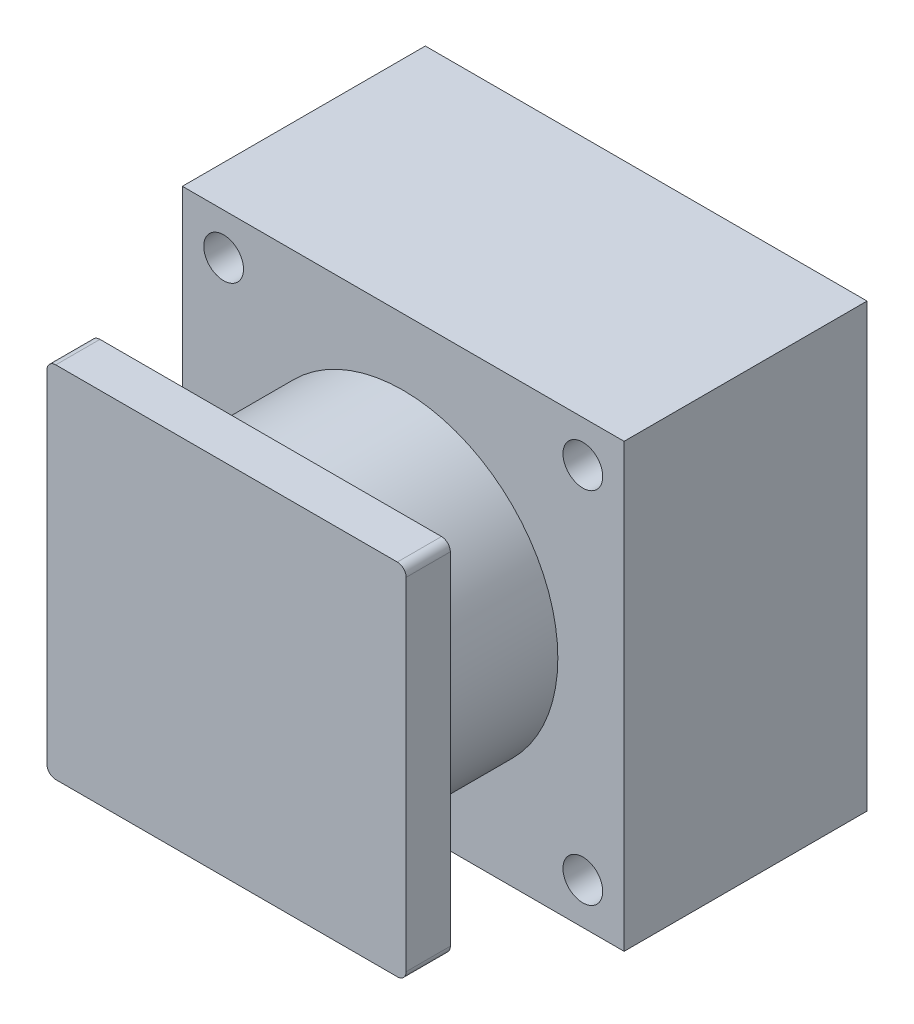
ISO-10303-21;
HEADER;
FILE_DESCRIPTION(('STEP AP214'),'2;1');
FILE_NAME('part.step','',(''),(''),'','','');
FILE_SCHEMA(('AUTOMOTIVE_DESIGN { 1 0 10303 214 1 1 1 1 }'));
ENDSEC;
DATA;
#1=APPLICATION_CONTEXT('core data for automotive mechanical design processes');
#2=APPLICATION_PROTOCOL_DEFINITION('international standard','automotive_design',2000,#1);
#3=PRODUCT_CONTEXT('',#1,'mechanical');
#4=PRODUCT('Part','Part','',(#3));
#5=PRODUCT_RELATED_PRODUCT_CATEGORY('part','',(#4));
#6=PRODUCT_DEFINITION_FORMATION('','',#4);
#7=PRODUCT_DEFINITION_CONTEXT('part definition',#1,'design');
#8=PRODUCT_DEFINITION('design','',#6,#7);
#9=PRODUCT_DEFINITION_SHAPE('','',#8);
#10=(LENGTH_UNIT() NAMED_UNIT(*) SI_UNIT(.MILLI.,.METRE.));
#11=(NAMED_UNIT(*) PLANE_ANGLE_UNIT() SI_UNIT($,.RADIAN.));
#12=(NAMED_UNIT(*) SI_UNIT($,.STERADIAN.) SOLID_ANGLE_UNIT());
#13=UNCERTAINTY_MEASURE_WITH_UNIT(LENGTH_MEASURE(1.E-05),#10,'distance_accuracy_value','');
#14=(GEOMETRIC_REPRESENTATION_CONTEXT(3) GLOBAL_UNCERTAINTY_ASSIGNED_CONTEXT((#13)) GLOBAL_UNIT_ASSIGNED_CONTEXT((#10,
#11,#12)) REPRESENTATION_CONTEXT('',''));
#15=CARTESIAN_POINT('',(0.,0.,0.));
#16=DIRECTION('',(0.,0.,1.));
#17=DIRECTION('',(1.,0.,0.));
#18=AXIS2_PLACEMENT_3D('',#15,#16,#17);
#19=CARTESIAN_POINT('',(0.,0.,55.));
#20=DIRECTION('',(0.,0.,1.));
#21=DIRECTION('',(1.,0.,0.));
#22=AXIS2_PLACEMENT_3D('',#19,#20,#21);
#23=PLANE('',#22);
#24=CARTESIAN_POINT('',(0.,0.,55.));
#25=DIRECTION('',(0.,0.,1.));
#26=DIRECTION('',(1.,0.,0.));
#27=AXIS2_PLACEMENT_3D('',#24,#25,#26);
#28=CIRCLE('',#27,35.);
#29=CARTESIAN_POINT('',(35.,0.,55.));
#30=VERTEX_POINT('',#29);
#31=EDGE_CURVE('E249',#30,#30,#28,.T.);
#32=ORIENTED_EDGE('',*,*,#31,.F.);
#33=EDGE_LOOP('',(#32));
#34=FACE_BOUND('',#33,.T.);
#35=CARTESIAN_POINT('',(40.6586399182265,-40.6586399182264,55.));
#36=DIRECTION('',(0.,0.,1.));
#37=DIRECTION('',(1.,0.,0.));
#38=AXIS2_PLACEMENT_3D('',#35,#36,#37);
#39=CIRCLE('',#38,4.5);
#40=CARTESIAN_POINT('',(45.1586399182265,-40.6586399182264,55.));
#41=VERTEX_POINT('',#40);
#42=EDGE_CURVE('E261',#41,#41,#39,.T.);
#43=ORIENTED_EDGE('',*,*,#42,.F.);
#44=EDGE_LOOP('',(#43));
#45=FACE_BOUND('',#44,.T.);
#46=CARTESIAN_POINT('',(-40.6586399182264,40.6586399182264,55.));
#47=DIRECTION('',(0.,0.,1.));
#48=DIRECTION('',(1.,0.,0.));
#49=AXIS2_PLACEMENT_3D('',#46,#47,#48);
#50=CIRCLE('',#49,4.5);
#51=CARTESIAN_POINT('',(-36.1586399182264,40.6586399182264,55.));
#52=VERTEX_POINT('',#51);
#53=EDGE_CURVE('E277',#52,#52,#50,.T.);
#54=ORIENTED_EDGE('',*,*,#53,.F.);
#55=EDGE_LOOP('',(#54));
#56=FACE_BOUND('',#55,.T.);
#57=DIRECTION('',(0.,1.,0.));
#58=VECTOR('',#57,1.);
#59=CARTESIAN_POINT('',(50.,50.,55.));
#60=LINE('',#59,#58);
#61=CARTESIAN_POINT('',(50.,-50.,55.));
#62=VERTEX_POINT('',#61);
#63=CARTESIAN_POINT('',(50.,50.,55.));
#64=VERTEX_POINT('',#63);
#65=EDGE_CURVE('E143',#62,#64,#60,.T.);
#66=ORIENTED_EDGE('',*,*,#65,.T.);
#67=DIRECTION('',(-1.,0.,0.));
#68=VECTOR('',#67,1.);
#69=CARTESIAN_POINT('',(-50.,50.,55.));
#70=LINE('',#69,#68);
#71=CARTESIAN_POINT('',(-50.,50.,55.));
#72=VERTEX_POINT('',#71);
#73=EDGE_CURVE('E131',#64,#72,#70,.T.);
#74=ORIENTED_EDGE('',*,*,#73,.T.);
#75=DIRECTION('',(0.,-1.,0.));
#76=VECTOR('',#75,1.);
#77=CARTESIAN_POINT('',(-50.,50.,55.));
#78=LINE('',#77,#76);
#79=CARTESIAN_POINT('',(-50.,-50.,55.));
#80=VERTEX_POINT('',#79);
#81=EDGE_CURVE('E142',#72,#80,#78,.T.);
#82=ORIENTED_EDGE('',*,*,#81,.T.);
#83=DIRECTION('',(1.,0.,0.));
#84=VECTOR('',#83,1.);
#85=CARTESIAN_POINT('',(-50.,-50.,55.));
#86=LINE('',#85,#84);
#87=EDGE_CURVE('E148',#80,#62,#86,.T.);
#88=ORIENTED_EDGE('',*,*,#87,.T.);
#89=EDGE_LOOP('',(#66,#74,#82,#88));
#90=FACE_BOUND('',#89,.T.);
#91=CARTESIAN_POINT('',(40.6586399182265,40.6586399182264,55.));
#92=DIRECTION('',(0.,0.,1.));
#93=DIRECTION('',(1.,0.,0.));
#94=AXIS2_PLACEMENT_3D('',#91,#92,#93);
#95=CIRCLE('',#94,4.5);
#96=CARTESIAN_POINT('',(45.1586399182265,40.6586399182264,55.));
#97=VERTEX_POINT('',#96);
#98=EDGE_CURVE('E269',#97,#97,#95,.T.);
#99=ORIENTED_EDGE('',*,*,#98,.F.);
#100=EDGE_LOOP('',(#99));
#101=FACE_BOUND('',#100,.T.);
#102=CARTESIAN_POINT('',(-40.6586399182263,-40.6586399182264,55.));
#103=DIRECTION('',(0.,0.,1.));
#104=DIRECTION('',(1.,0.,0.));
#105=AXIS2_PLACEMENT_3D('',#102,#103,#104);
#106=CIRCLE('',#105,4.5);
#107=CARTESIAN_POINT('',(-36.1586399182264,-40.6586399182264,55.));
#108=VERTEX_POINT('',#107);
#109=EDGE_CURVE('E253',#108,#108,#106,.T.);
#110=ORIENTED_EDGE('',*,*,#109,.F.);
#111=EDGE_LOOP('',(#110));
#112=FACE_BOUND('',#111,.T.);
#113=ADVANCED_FACE('F39',(#34,#45,#56,#90,#101,#112),#23,.T.);
#114=CARTESIAN_POINT('',(0.,0.,0.));
#115=DIRECTION('',(0.,0.,1.));
#116=DIRECTION('',(1.,0.,0.));
#117=AXIS2_PLACEMENT_3D('',#114,#115,#116);
#118=PLANE('',#117);
#119=DIRECTION('',(0.,1.,0.));
#120=VECTOR('',#119,1.);
#121=CARTESIAN_POINT('',(50.,50.,0.));
#122=LINE('',#121,#120);
#123=CARTESIAN_POINT('',(50.,-50.,0.));
#124=VERTEX_POINT('',#123);
#125=CARTESIAN_POINT('',(50.,50.,0.));
#126=VERTEX_POINT('',#125);
#127=EDGE_CURVE('E157',#124,#126,#122,.T.);
#128=ORIENTED_EDGE('',*,*,#127,.F.);
#129=DIRECTION('',(1.,0.,0.));
#130=VECTOR('',#129,1.);
#131=CARTESIAN_POINT('',(-50.,-50.,0.));
#132=LINE('',#131,#130);
#133=CARTESIAN_POINT('',(-50.,-50.,0.));
#134=VERTEX_POINT('',#133);
#135=EDGE_CURVE('E153',#134,#124,#132,.T.);
#136=ORIENTED_EDGE('',*,*,#135,.F.);
#137=DIRECTION('',(0.,-1.,0.));
#138=VECTOR('',#137,1.);
#139=CARTESIAN_POINT('',(-50.,50.,0.));
#140=LINE('',#139,#138);
#141=CARTESIAN_POINT('',(-50.,50.,0.));
#142=VERTEX_POINT('',#141);
#143=EDGE_CURVE('E294',#142,#134,#140,.T.);
#144=ORIENTED_EDGE('',*,*,#143,.F.);
#145=DIRECTION('',(-1.,0.,0.));
#146=VECTOR('',#145,1.);
#147=CARTESIAN_POINT('',(-50.,50.,0.));
#148=LINE('',#147,#146);
#149=EDGE_CURVE('E291',#126,#142,#148,.T.);
#150=ORIENTED_EDGE('',*,*,#149,.F.);
#151=EDGE_LOOP('',(#128,#136,#144,#150));
#152=FACE_BOUND('',#151,.T.);
#153=CARTESIAN_POINT('',(-40.6586399182264,40.6586399182264,0.));
#154=DIRECTION('',(0.,0.,1.));
#155=DIRECTION('',(1.,0.,0.));
#156=AXIS2_PLACEMENT_3D('',#153,#154,#155);
#157=CIRCLE('',#156,4.5);
#158=CARTESIAN_POINT('',(-36.1586399182264,40.6586399182264,0.));
#159=VERTEX_POINT('',#158);
#160=EDGE_CURVE('E273',#159,#159,#157,.T.);
#161=ORIENTED_EDGE('',*,*,#160,.T.);
#162=EDGE_LOOP('',(#161));
#163=FACE_BOUND('',#162,.T.);
#164=CARTESIAN_POINT('',(40.6586399182265,40.6586399182264,0.));
#165=DIRECTION('',(0.,0.,1.));
#166=DIRECTION('',(1.,0.,0.));
#167=AXIS2_PLACEMENT_3D('',#164,#165,#166);
#168=CIRCLE('',#167,4.5);
#169=CARTESIAN_POINT('',(45.1586399182265,40.6586399182264,0.));
#170=VERTEX_POINT('',#169);
#171=EDGE_CURVE('E265',#170,#170,#168,.T.);
#172=ORIENTED_EDGE('',*,*,#171,.T.);
#173=EDGE_LOOP('',(#172));
#174=FACE_BOUND('',#173,.T.);
#175=CARTESIAN_POINT('',(40.6586399182265,-40.6586399182264,0.));
#176=DIRECTION('',(0.,0.,1.));
#177=DIRECTION('',(1.,0.,0.));
#178=AXIS2_PLACEMENT_3D('',#175,#176,#177);
#179=CIRCLE('',#178,4.5);
#180=CARTESIAN_POINT('',(45.1586399182265,-40.6586399182264,0.));
#181=VERTEX_POINT('',#180);
#182=EDGE_CURVE('E257',#181,#181,#179,.T.);
#183=ORIENTED_EDGE('',*,*,#182,.T.);
#184=EDGE_LOOP('',(#183));
#185=FACE_BOUND('',#184,.T.);
#186=CARTESIAN_POINT('',(-40.6586399182263,-40.6586399182264,0.));
#187=DIRECTION('',(0.,0.,1.));
#188=DIRECTION('',(1.,0.,0.));
#189=AXIS2_PLACEMENT_3D('',#186,#187,#188);
#190=CIRCLE('',#189,4.5);
#191=CARTESIAN_POINT('',(-36.1586399182264,-40.6586399182264,0.));
#192=VERTEX_POINT('',#191);
#193=EDGE_CURVE('E248',#192,#192,#190,.T.);
#194=ORIENTED_EDGE('',*,*,#193,.T.);
#195=EDGE_LOOP('',(#194));
#196=FACE_BOUND('',#195,.T.);
#197=ADVANCED_FACE('F309',(#152,#163,#174,#185,#196),#118,.F.);
#198=CARTESIAN_POINT('',(50.,50.,55.));
#199=DIRECTION('',(-1.,0.,0.));
#200=DIRECTION('',(0.,-1.,0.));
#201=AXIS2_PLACEMENT_3D('',#198,#199,#200);
#202=PLANE('',#201);
#203=ORIENTED_EDGE('',*,*,#127,.T.);
#204=DIRECTION('',(0.,0.,-1.));
#205=VECTOR('',#204,1.);
#206=CARTESIAN_POINT('',(50.,50.,55.));
#207=LINE('',#206,#205);
#208=EDGE_CURVE('E135',#64,#126,#207,.T.);
#209=ORIENTED_EDGE('',*,*,#208,.F.);
#210=ORIENTED_EDGE('',*,*,#65,.F.);
#211=DIRECTION('',(0.,0.,-1.));
#212=VECTOR('',#211,1.);
#213=CARTESIAN_POINT('',(50.,-50.,55.));
#214=LINE('',#213,#212);
#215=EDGE_CURVE('E288',#62,#124,#214,.T.);
#216=ORIENTED_EDGE('',*,*,#215,.T.);
#217=EDGE_LOOP('',(#203,#209,#210,#216));
#218=FACE_BOUND('',#217,.T.);
#219=ADVANCED_FACE('F155',(#218),#202,.F.);
#220=CARTESIAN_POINT('',(-50.,50.,55.));
#221=DIRECTION('',(0.,-1.,0.));
#222=DIRECTION('',(0.,0.,-1.));
#223=AXIS2_PLACEMENT_3D('',#220,#221,#222);
#224=PLANE('',#223);
#225=ORIENTED_EDGE('',*,*,#149,.T.);
#226=DIRECTION('',(0.,0.,-1.));
#227=VECTOR('',#226,1.);
#228=CARTESIAN_POINT('',(-50.,50.,55.));
#229=LINE('',#228,#227);
#230=EDGE_CURVE('E138',#72,#142,#229,.T.);
#231=ORIENTED_EDGE('',*,*,#230,.F.);
#232=ORIENTED_EDGE('',*,*,#73,.F.);
#233=ORIENTED_EDGE('',*,*,#208,.T.);
#234=EDGE_LOOP('',(#225,#231,#232,#233));
#235=FACE_BOUND('',#234,.T.);
#236=ADVANCED_FACE('F133',(#235),#224,.F.);
#237=CARTESIAN_POINT('',(-50.,50.,55.));
#238=DIRECTION('',(1.,0.,0.));
#239=DIRECTION('',(0.,1.,0.));
#240=AXIS2_PLACEMENT_3D('',#237,#238,#239);
#241=PLANE('',#240);
#242=ORIENTED_EDGE('',*,*,#143,.T.);
#243=DIRECTION('',(0.,0.,-1.));
#244=VECTOR('',#243,1.);
#245=CARTESIAN_POINT('',(-50.,-50.,55.));
#246=LINE('',#245,#244);
#247=EDGE_CURVE('E165',#80,#134,#246,.T.);
#248=ORIENTED_EDGE('',*,*,#247,.F.);
#249=ORIENTED_EDGE('',*,*,#81,.F.);
#250=ORIENTED_EDGE('',*,*,#230,.T.);
#251=EDGE_LOOP('',(#242,#248,#249,#250));
#252=FACE_BOUND('',#251,.T.);
#253=ADVANCED_FACE('F311',(#252),#241,.F.);
#254=CARTESIAN_POINT('',(-50.,-50.,55.));
#255=DIRECTION('',(0.,1.,0.));
#256=DIRECTION('',(0.,0.,1.));
#257=AXIS2_PLACEMENT_3D('',#254,#255,#256);
#258=PLANE('',#257);
#259=ORIENTED_EDGE('',*,*,#135,.T.);
#260=ORIENTED_EDGE('',*,*,#215,.F.);
#261=ORIENTED_EDGE('',*,*,#87,.F.);
#262=ORIENTED_EDGE('',*,*,#247,.T.);
#263=EDGE_LOOP('',(#259,#260,#261,#262));
#264=FACE_BOUND('',#263,.T.);
#265=ADVANCED_FACE('F305',(#264),#258,.F.);
#266=CARTESIAN_POINT('',(-40.6586399182264,40.6586399182264,55.));
#267=DIRECTION('',(0.,0.,-1.));
#268=DIRECTION('',(-1.,0.,0.));
#269=AXIS2_PLACEMENT_3D('',#266,#267,#268);
#270=CYLINDRICAL_SURFACE('',#269,4.5);
#271=ORIENTED_EDGE('',*,*,#53,.T.);
#272=EDGE_LOOP('',(#271));
#273=FACE_BOUND('',#272,.T.);
#274=ORIENTED_EDGE('',*,*,#160,.F.);
#275=EDGE_LOOP('',(#274));
#276=FACE_BOUND('',#275,.T.);
#277=ADVANCED_FACE('F318',(#273,#276),#270,.F.);
#278=CARTESIAN_POINT('',(40.6586399182265,40.6586399182264,55.));
#279=DIRECTION('',(0.,0.,-1.));
#280=DIRECTION('',(-1.,0.,0.));
#281=AXIS2_PLACEMENT_3D('',#278,#279,#280);
#282=CYLINDRICAL_SURFACE('',#281,4.5);
#283=ORIENTED_EDGE('',*,*,#98,.T.);
#284=EDGE_LOOP('',(#283));
#285=FACE_BOUND('',#284,.T.);
#286=ORIENTED_EDGE('',*,*,#171,.F.);
#287=EDGE_LOOP('',(#286));
#288=FACE_BOUND('',#287,.T.);
#289=ADVANCED_FACE('F333',(#285,#288),#282,.F.);
#290=CARTESIAN_POINT('',(40.6586399182265,-40.6586399182264,55.));
#291=DIRECTION('',(0.,0.,-1.));
#292=DIRECTION('',(-1.,0.,0.));
#293=AXIS2_PLACEMENT_3D('',#290,#291,#292);
#294=CYLINDRICAL_SURFACE('',#293,4.5);
#295=ORIENTED_EDGE('',*,*,#42,.T.);
#296=EDGE_LOOP('',(#295));
#297=FACE_BOUND('',#296,.T.);
#298=ORIENTED_EDGE('',*,*,#182,.F.);
#299=EDGE_LOOP('',(#298));
#300=FACE_BOUND('',#299,.T.);
#301=ADVANCED_FACE('F337',(#297,#300),#294,.F.);
#302=CARTESIAN_POINT('',(-40.6586399182263,-40.6586399182264,55.));
#303=DIRECTION('',(0.,0.,-1.));
#304=DIRECTION('',(-1.,0.,0.));
#305=AXIS2_PLACEMENT_3D('',#302,#303,#304);
#306=CYLINDRICAL_SURFACE('',#305,4.5);
#307=ORIENTED_EDGE('',*,*,#109,.T.);
#308=EDGE_LOOP('',(#307));
#309=FACE_BOUND('',#308,.T.);
#310=ORIENTED_EDGE('',*,*,#193,.F.);
#311=EDGE_LOOP('',(#310));
#312=FACE_BOUND('',#311,.T.);
#313=ADVANCED_FACE('F341',(#309,#312),#306,.F.);
#314=CARTESIAN_POINT('',(0.,0.,85.));
#315=DIRECTION('',(0.,0.,-1.));
#316=DIRECTION('',(-1.,0.,0.));
#317=AXIS2_PLACEMENT_3D('',#314,#315,#316);
#318=CYLINDRICAL_SURFACE('',#317,35.);
#319=CARTESIAN_POINT('',(0.,0.,85.));
#320=DIRECTION('',(0.,0.,1.));
#321=DIRECTION('',(1.,0.,0.));
#322=AXIS2_PLACEMENT_3D('',#319,#320,#321);
#323=CIRCLE('',#322,35.);
#324=CARTESIAN_POINT('',(35.,0.,85.));
#325=VERTEX_POINT('',#324);
#326=EDGE_CURVE('E244',#325,#325,#323,.T.);
#327=ORIENTED_EDGE('',*,*,#326,.F.);
#328=EDGE_LOOP('',(#327));
#329=FACE_BOUND('',#328,.T.);
#330=ORIENTED_EDGE('',*,*,#31,.T.);
#331=EDGE_LOOP('',(#330));
#332=FACE_BOUND('',#331,.T.);
#333=ADVANCED_FACE('F345',(#329,#332),#318,.T.);
#334=CARTESIAN_POINT('',(40.6586399182265,40.6586399182264,95.));
#335=DIRECTION('',(-1.,0.,0.));
#336=DIRECTION('',(0.,0.,1.));
#337=AXIS2_PLACEMENT_3D('',#334,#335,#336);
#338=PLANE('',#337);
#339=DIRECTION('',(0.,1.,0.));
#340=VECTOR('',#339,1.);
#341=CARTESIAN_POINT('',(40.6586399182265,40.6586399182264,85.));
#342=LINE('',#341,#340);
#343=CARTESIAN_POINT('',(40.6586399182265,-38.6586399182264,85.));
#344=VERTEX_POINT('',#343);
#345=CARTESIAN_POINT('',(40.6586399182265,38.6586399182264,85.));
#346=VERTEX_POINT('',#345);
#347=EDGE_CURVE('E507',#344,#346,#342,.T.);
#348=ORIENTED_EDGE('',*,*,#347,.T.);
#349=DIRECTION('',(0.,0.,-1.));
#350=VECTOR('',#349,1.);
#351=CARTESIAN_POINT('',(40.6586399182265,38.6586399182264,95.));
#352=LINE('',#351,#350);
#353=CARTESIAN_POINT('',(40.6586399182265,38.6586399182264,95.));
#354=VERTEX_POINT('',#353);
#355=EDGE_CURVE('E188',#346,#354,#352,.F.);
#356=ORIENTED_EDGE('',*,*,#355,.T.);
#357=DIRECTION('',(0.,1.,0.));
#358=VECTOR('',#357,1.);
#359=CARTESIAN_POINT('',(40.6586399182265,40.6586399182264,95.));
#360=LINE('',#359,#358);
#361=CARTESIAN_POINT('',(40.6586399182265,-38.6586399182264,95.));
#362=VERTEX_POINT('',#361);
#363=EDGE_CURVE('E235',#362,#354,#360,.T.);
#364=ORIENTED_EDGE('',*,*,#363,.F.);
#365=DIRECTION('',(0.,0.,-1.));
#366=VECTOR('',#365,1.);
#367=CARTESIAN_POINT('',(40.6586399182265,-38.6586399182264,95.));
#368=LINE('',#367,#366);
#369=EDGE_CURVE('E184',#362,#344,#368,.T.);
#370=ORIENTED_EDGE('',*,*,#369,.T.);
#371=EDGE_LOOP('',(#348,#356,#364,#370));
#372=FACE_BOUND('',#371,.T.);
#373=ADVANCED_FACE('F349',(#372),#338,.F.);
#374=CARTESIAN_POINT('',(-40.6586399182265,40.6586399182264,95.));
#375=DIRECTION('',(0.,-1.,0.));
#376=DIRECTION('',(0.,0.,-1.));
#377=AXIS2_PLACEMENT_3D('',#374,#375,#376);
#378=PLANE('',#377);
#379=DIRECTION('',(-1.,0.,0.));
#380=VECTOR('',#379,1.);
#381=CARTESIAN_POINT('',(-40.6586399182265,40.6586399182264,95.));
#382=LINE('',#381,#380);
#383=CARTESIAN_POINT('',(38.6586399182265,40.6586399182264,95.));
#384=VERTEX_POINT('',#383);
#385=CARTESIAN_POINT('',(-38.6586399182265,40.6586399182264,95.));
#386=VERTEX_POINT('',#385);
#387=EDGE_CURVE('E224',#384,#386,#382,.T.);
#388=ORIENTED_EDGE('',*,*,#387,.F.);
#389=DIRECTION('',(0.,0.,-1.));
#390=VECTOR('',#389,1.);
#391=CARTESIAN_POINT('',(38.6586399182265,40.6586399182264,95.));
#392=LINE('',#391,#390);
#393=CARTESIAN_POINT('',(38.6586399182265,40.6586399182264,85.));
#394=VERTEX_POINT('',#393);
#395=EDGE_CURVE('E163',#384,#394,#392,.T.);
#396=ORIENTED_EDGE('',*,*,#395,.T.);
#397=DIRECTION('',(-1.,0.,0.));
#398=VECTOR('',#397,1.);
#399=CARTESIAN_POINT('',(-40.6586399182265,40.6586399182264,85.));
#400=LINE('',#399,#398);
#401=CARTESIAN_POINT('',(-38.6586399182265,40.6586399182264,85.));
#402=VERTEX_POINT('',#401);
#403=EDGE_CURVE('E240',#394,#402,#400,.T.);
#404=ORIENTED_EDGE('',*,*,#403,.T.);
#405=DIRECTION('',(0.,0.,-1.));
#406=VECTOR('',#405,1.);
#407=CARTESIAN_POINT('',(-38.6586399182265,40.6586399182264,95.));
#408=LINE('',#407,#406);
#409=EDGE_CURVE('E159',#402,#386,#408,.F.);
#410=ORIENTED_EDGE('',*,*,#409,.T.);
#411=EDGE_LOOP('',(#388,#396,#404,#410));
#412=FACE_BOUND('',#411,.T.);
#413=ADVANCED_FACE('F353',(#412),#378,.F.);
#414=CARTESIAN_POINT('',(-40.6586399182265,40.6586399182264,95.));
#415=DIRECTION('',(1.,0.,0.));
#416=DIRECTION('',(0.,0.,-1.));
#417=AXIS2_PLACEMENT_3D('',#414,#415,#416);
#418=PLANE('',#417);
#419=DIRECTION('',(0.,-1.,0.));
#420=VECTOR('',#419,1.);
#421=CARTESIAN_POINT('',(-40.6586399182265,40.6586399182264,95.));
#422=LINE('',#421,#420);
#423=CARTESIAN_POINT('',(-40.6586399182265,38.6586399182264,95.));
#424=VERTEX_POINT('',#423);
#425=CARTESIAN_POINT('',(-40.6586399182265,-38.6586399182264,95.));
#426=VERTEX_POINT('',#425);
#427=EDGE_CURVE('E213',#424,#426,#422,.T.);
#428=ORIENTED_EDGE('',*,*,#427,.F.);
#429=DIRECTION('',(0.,0.,-1.));
#430=VECTOR('',#429,1.);
#431=CARTESIAN_POINT('',(-40.6586399182265,38.6586399182264,95.));
#432=LINE('',#431,#430);
#433=CARTESIAN_POINT('',(-40.6586399182265,38.6586399182264,85.));
#434=VERTEX_POINT('',#433);
#435=EDGE_CURVE('E11',#424,#434,#432,.T.);
#436=ORIENTED_EDGE('',*,*,#435,.T.);
#437=DIRECTION('',(0.,-1.,0.));
#438=VECTOR('',#437,1.);
#439=CARTESIAN_POINT('',(-40.6586399182265,40.6586399182264,85.));
#440=LINE('',#439,#438);
#441=CARTESIAN_POINT('',(-40.6586399182265,-38.6586399182264,85.));
#442=VERTEX_POINT('',#441);
#443=EDGE_CURVE('E216',#434,#442,#440,.T.);
#444=ORIENTED_EDGE('',*,*,#443,.T.);
#445=DIRECTION('',(0.,0.,-1.));
#446=VECTOR('',#445,1.);
#447=CARTESIAN_POINT('',(-40.6586399182265,-38.6586399182264,95.));
#448=LINE('',#447,#446);
#449=EDGE_CURVE('E48',#442,#426,#448,.F.);
#450=ORIENTED_EDGE('',*,*,#449,.T.);
#451=EDGE_LOOP('',(#428,#436,#444,#450));
#452=FACE_BOUND('',#451,.T.);
#453=ADVANCED_FACE('F212',(#452),#418,.F.);
#454=CARTESIAN_POINT('',(-40.6586399182265,-40.6586399182264,95.));
#455=DIRECTION('',(0.,1.,0.));
#456=DIRECTION('',(0.,0.,1.));
#457=AXIS2_PLACEMENT_3D('',#454,#455,#456);
#458=PLANE('',#457);
#459=DIRECTION('',(1.,0.,0.));
#460=VECTOR('',#459,1.);
#461=CARTESIAN_POINT('',(-40.6586399182265,-40.6586399182264,85.));
#462=LINE('',#461,#460);
#463=CARTESIAN_POINT('',(-38.6586399182265,-40.6586399182264,85.));
#464=VERTEX_POINT('',#463);
#465=CARTESIAN_POINT('',(38.6586399182265,-40.6586399182264,85.));
#466=VERTEX_POINT('',#465);
#467=EDGE_CURVE('E229',#464,#466,#462,.T.);
#468=ORIENTED_EDGE('',*,*,#467,.T.);
#469=DIRECTION('',(0.,0.,-1.));
#470=VECTOR('',#469,1.);
#471=CARTESIAN_POINT('',(38.6586399182265,-40.6586399182264,95.));
#472=LINE('',#471,#470);
#473=CARTESIAN_POINT('',(38.6586399182265,-40.6586399182264,95.));
#474=VERTEX_POINT('',#473);
#475=EDGE_CURVE('E55',#466,#474,#472,.F.);
#476=ORIENTED_EDGE('',*,*,#475,.T.);
#477=DIRECTION('',(1.,0.,0.));
#478=VECTOR('',#477,1.);
#479=CARTESIAN_POINT('',(-40.6586399182265,-40.6586399182264,95.));
#480=LINE('',#479,#478);
#481=CARTESIAN_POINT('',(-38.6586399182265,-40.6586399182264,95.));
#482=VERTEX_POINT('',#481);
#483=EDGE_CURVE('E223',#482,#474,#480,.T.);
#484=ORIENTED_EDGE('',*,*,#483,.F.);
#485=DIRECTION('',(0.,0.,-1.));
#486=VECTOR('',#485,1.);
#487=CARTESIAN_POINT('',(-38.6586399182265,-40.6586399182264,95.));
#488=LINE('',#487,#486);
#489=EDGE_CURVE('E202',#482,#464,#488,.T.);
#490=ORIENTED_EDGE('',*,*,#489,.T.);
#491=EDGE_LOOP('',(#468,#476,#484,#490));
#492=FACE_BOUND('',#491,.T.);
#493=ADVANCED_FACE('F228',(#492),#458,.F.);
#494=CARTESIAN_POINT('',(0.,0.,95.));
#495=DIRECTION('',(0.,0.,1.));
#496=DIRECTION('',(1.,0.,0.));
#497=AXIS2_PLACEMENT_3D('',#494,#495,#496);
#498=PLANE('',#497);
#499=ORIENTED_EDGE('',*,*,#363,.T.);
#500=CARTESIAN_POINT('',(38.6586399182265,38.6586399182264,95.));
#501=DIRECTION('',(0.,0.,1.));
#502=DIRECTION('',(1.,0.,0.));
#503=AXIS2_PLACEMENT_3D('',#500,#501,#502);
#504=CIRCLE('',#503,2.);
#505=EDGE_CURVE('E199',#354,#384,#504,.T.);
#506=ORIENTED_EDGE('',*,*,#505,.T.);
#507=ORIENTED_EDGE('',*,*,#387,.T.);
#508=CARTESIAN_POINT('',(-38.6586399182265,38.6586399182264,95.));
#509=DIRECTION('',(0.,0.,1.));
#510=DIRECTION('',(1.,0.,0.));
#511=AXIS2_PLACEMENT_3D('',#508,#509,#510);
#512=CIRCLE('',#511,2.);
#513=EDGE_CURVE('E193',#386,#424,#512,.T.);
#514=ORIENTED_EDGE('',*,*,#513,.T.);
#515=ORIENTED_EDGE('',*,*,#427,.T.);
#516=CARTESIAN_POINT('',(-38.6586399182265,-38.6586399182264,95.));
#517=DIRECTION('',(0.,0.,1.));
#518=DIRECTION('',(1.,0.,0.));
#519=AXIS2_PLACEMENT_3D('',#516,#517,#518);
#520=CIRCLE('',#519,2.);
#521=EDGE_CURVE('E62',#426,#482,#520,.T.);
#522=ORIENTED_EDGE('',*,*,#521,.T.);
#523=ORIENTED_EDGE('',*,*,#483,.T.);
#524=CARTESIAN_POINT('',(38.6586399182265,-38.6586399182264,95.));
#525=DIRECTION('',(0.,0.,1.));
#526=DIRECTION('',(1.,0.,0.));
#527=AXIS2_PLACEMENT_3D('',#524,#525,#526);
#528=CIRCLE('',#527,2.);
#529=EDGE_CURVE('E196',#474,#362,#528,.T.);
#530=ORIENTED_EDGE('',*,*,#529,.T.);
#531=EDGE_LOOP('',(#499,#506,#507,#514,#515,#522,#523,#530));
#532=FACE_BOUND('',#531,.T.);
#533=ADVANCED_FACE('F219',(#532),#498,.T.);
#534=CARTESIAN_POINT('',(0.,0.,85.));
#535=DIRECTION('',(0.,0.,1.));
#536=DIRECTION('',(1.,0.,0.));
#537=AXIS2_PLACEMENT_3D('',#534,#535,#536);
#538=PLANE('',#537);
#539=ORIENTED_EDGE('',*,*,#326,.T.);
#540=EDGE_LOOP('',(#539));
#541=FACE_BOUND('',#540,.T.);
#542=ORIENTED_EDGE('',*,*,#403,.F.);
#543=CARTESIAN_POINT('',(38.6586399182265,38.6586399182264,85.));
#544=DIRECTION('',(0.,0.,1.));
#545=DIRECTION('',(1.,0.,0.));
#546=AXIS2_PLACEMENT_3D('',#543,#544,#545);
#547=CIRCLE('',#546,2.);
#548=EDGE_CURVE('E181',#394,#346,#547,.F.);
#549=ORIENTED_EDGE('',*,*,#548,.T.);
#550=ORIENTED_EDGE('',*,*,#347,.F.);
#551=CARTESIAN_POINT('',(38.6586399182265,-38.6586399182264,85.));
#552=DIRECTION('',(0.,0.,1.));
#553=DIRECTION('',(1.,0.,0.));
#554=AXIS2_PLACEMENT_3D('',#551,#552,#553);
#555=CIRCLE('',#554,2.);
#556=EDGE_CURVE('E178',#344,#466,#555,.F.);
#557=ORIENTED_EDGE('',*,*,#556,.T.);
#558=ORIENTED_EDGE('',*,*,#467,.F.);
#559=CARTESIAN_POINT('',(-38.6586399182265,-38.6586399182264,85.));
#560=DIRECTION('',(0.,0.,1.));
#561=DIRECTION('',(1.,0.,0.));
#562=AXIS2_PLACEMENT_3D('',#559,#560,#561);
#563=CIRCLE('',#562,2.);
#564=EDGE_CURVE('E172',#464,#442,#563,.F.);
#565=ORIENTED_EDGE('',*,*,#564,.T.);
#566=ORIENTED_EDGE('',*,*,#443,.F.);
#567=CARTESIAN_POINT('',(-38.6586399182265,38.6586399182264,85.));
#568=DIRECTION('',(0.,0.,1.));
#569=DIRECTION('',(1.,0.,0.));
#570=AXIS2_PLACEMENT_3D('',#567,#568,#569);
#571=CIRCLE('',#570,2.);
#572=EDGE_CURVE('E175',#434,#402,#571,.F.);
#573=ORIENTED_EDGE('',*,*,#572,.T.);
#574=EDGE_LOOP('',(#542,#549,#550,#557,#558,#565,#566,#573));
#575=FACE_BOUND('',#574,.T.);
#576=ADVANCED_FACE('F232',(#541,#575),#538,.F.);
#577=CARTESIAN_POINT('',(38.6586399182265,38.6586399182264,95.));
#578=DIRECTION('',(0.,0.,-1.));
#579=DIRECTION('',(-1.,0.,0.));
#580=AXIS2_PLACEMENT_3D('',#577,#578,#579);
#581=CYLINDRICAL_SURFACE('',#580,2.);
#582=ORIENTED_EDGE('',*,*,#505,.F.);
#583=ORIENTED_EDGE('',*,*,#355,.F.);
#584=ORIENTED_EDGE('',*,*,#548,.F.);
#585=ORIENTED_EDGE('',*,*,#395,.F.);
#586=EDGE_LOOP('',(#582,#583,#584,#585));
#587=FACE_BOUND('',#586,.T.);
#588=ADVANCED_FACE('F364',(#587),#581,.T.);
#589=CARTESIAN_POINT('',(38.6586399182265,-38.6586399182264,95.));
#590=DIRECTION('',(0.,0.,-1.));
#591=DIRECTION('',(-1.,0.,0.));
#592=AXIS2_PLACEMENT_3D('',#589,#590,#591);
#593=CYLINDRICAL_SURFACE('',#592,2.);
#594=ORIENTED_EDGE('',*,*,#529,.F.);
#595=ORIENTED_EDGE('',*,*,#475,.F.);
#596=ORIENTED_EDGE('',*,*,#556,.F.);
#597=ORIENTED_EDGE('',*,*,#369,.F.);
#598=EDGE_LOOP('',(#594,#595,#596,#597));
#599=FACE_BOUND('',#598,.T.);
#600=ADVANCED_FACE('F381',(#599),#593,.T.);
#601=CARTESIAN_POINT('',(-38.6586399182265,38.6586399182264,95.));
#602=DIRECTION('',(0.,0.,-1.));
#603=DIRECTION('',(-1.,0.,0.));
#604=AXIS2_PLACEMENT_3D('',#601,#602,#603);
#605=CYLINDRICAL_SURFACE('',#604,2.);
#606=ORIENTED_EDGE('',*,*,#513,.F.);
#607=ORIENTED_EDGE('',*,*,#409,.F.);
#608=ORIENTED_EDGE('',*,*,#572,.F.);
#609=ORIENTED_EDGE('',*,*,#435,.F.);
#610=EDGE_LOOP('',(#606,#607,#608,#609));
#611=FACE_BOUND('',#610,.T.);
#612=ADVANCED_FACE('F389',(#611),#605,.T.);
#613=CARTESIAN_POINT('',(-38.6586399182265,-38.6586399182264,95.));
#614=DIRECTION('',(0.,0.,-1.));
#615=DIRECTION('',(-1.,0.,0.));
#616=AXIS2_PLACEMENT_3D('',#613,#614,#615);
#617=CYLINDRICAL_SURFACE('',#616,2.);
#618=ORIENTED_EDGE('',*,*,#521,.F.);
#619=ORIENTED_EDGE('',*,*,#449,.F.);
#620=ORIENTED_EDGE('',*,*,#564,.F.);
#621=ORIENTED_EDGE('',*,*,#489,.F.);
#622=EDGE_LOOP('',(#618,#619,#620,#621));
#623=FACE_BOUND('',#622,.T.);
#624=ADVANCED_FACE('F41',(#623),#617,.T.);
#625=CLOSED_SHELL('',(#113,#197,#219,#236,#253,#265,#277,#289,#301,#313,#333,#373,#413,#453,
#493,#533,#576,#588,#600,#612,#624));
#626=MANIFOLD_SOLID_BREP('B2',#625);
#627=ADVANCED_BREP_SHAPE_REPRESENTATION('',(#18,#626),#14);
#628=SHAPE_DEFINITION_REPRESENTATION(#9,#627);
ENDSEC;
END-ISO-10303-21;
